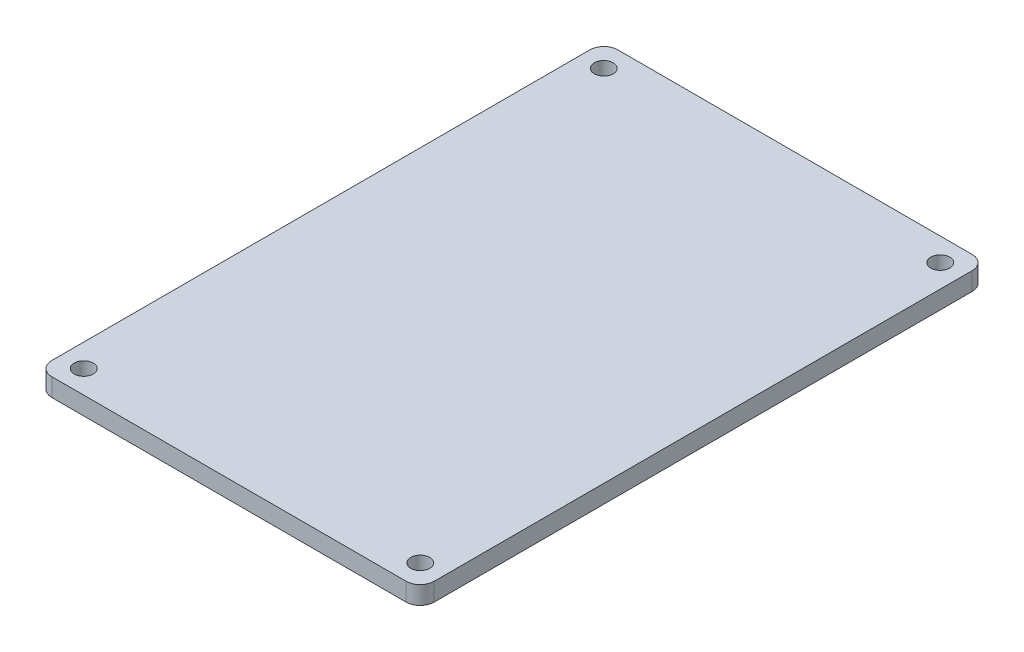
ISO-10303-21;
HEADER;
FILE_DESCRIPTION(('STEP AP214'),'2;1');
FILE_NAME('part.step','',(''),(''),'','','');
FILE_SCHEMA(('AUTOMOTIVE_DESIGN { 1 0 10303 214 1 1 1 1 }'));
ENDSEC;
DATA;
#1=APPLICATION_CONTEXT('core data for automotive mechanical design processes');
#2=APPLICATION_PROTOCOL_DEFINITION('international standard','automotive_design',2000,#1);
#3=PRODUCT_CONTEXT('',#1,'mechanical');
#4=PRODUCT('Part','Part','',(#3));
#5=PRODUCT_RELATED_PRODUCT_CATEGORY('part','',(#4));
#6=PRODUCT_DEFINITION_FORMATION('','',#4);
#7=PRODUCT_DEFINITION_CONTEXT('part definition',#1,'design');
#8=PRODUCT_DEFINITION('design','',#6,#7);
#9=PRODUCT_DEFINITION_SHAPE('','',#8);
#10=(LENGTH_UNIT() NAMED_UNIT(*) SI_UNIT(.MILLI.,.METRE.));
#11=(NAMED_UNIT(*) PLANE_ANGLE_UNIT() SI_UNIT($,.RADIAN.));
#12=(NAMED_UNIT(*) SI_UNIT($,.STERADIAN.) SOLID_ANGLE_UNIT());
#13=UNCERTAINTY_MEASURE_WITH_UNIT(LENGTH_MEASURE(1.E-05),#10,'distance_accuracy_value','');
#14=(GEOMETRIC_REPRESENTATION_CONTEXT(3) GLOBAL_UNCERTAINTY_ASSIGNED_CONTEXT((#13)) GLOBAL_UNIT_ASSIGNED_CONTEXT((#10,
#11,#12)) REPRESENTATION_CONTEXT('',''));
#15=CARTESIAN_POINT('',(0.,0.,0.));
#16=DIRECTION('',(0.,0.,1.));
#17=DIRECTION('',(1.,0.,0.));
#18=AXIS2_PLACEMENT_3D('',#15,#16,#17);
#19=CARTESIAN_POINT('',(-29.43,3.,44.68));
#20=DIRECTION('',(0.,-1.,0.));
#21=DIRECTION('',(0.,0.,-1.));
#22=AXIS2_PLACEMENT_3D('',#19,#20,#21);
#23=PLANE('',#22);
#24=CARTESIAN_POINT('',(27.94,3.,-43.18));
#25=DIRECTION('',(0.,1.,0.));
#26=DIRECTION('',(0.,0.,1.));
#27=AXIS2_PLACEMENT_3D('',#24,#25,#26);
#28=CIRCLE('',#27,1.58);
#29=CARTESIAN_POINT('',(27.94,3.,-41.6));
#30=VERTEX_POINT('',#29);
#31=EDGE_CURVE('E200',#30,#30,#28,.T.);
#32=ORIENTED_EDGE('',*,*,#31,.F.);
#33=EDGE_LOOP('',(#32));
#34=FACE_BOUND('',#33,.T.);
#35=CARTESIAN_POINT('',(-27.94,3.,-43.18));
#36=DIRECTION('',(0.,1.,0.));
#37=DIRECTION('',(0.,0.,1.));
#38=AXIS2_PLACEMENT_3D('',#35,#36,#37);
#39=CIRCLE('',#38,1.58);
#40=CARTESIAN_POINT('',(-27.94,3.,-41.6));
#41=VERTEX_POINT('',#40);
#42=EDGE_CURVE('E194',#41,#41,#39,.T.);
#43=ORIENTED_EDGE('',*,*,#42,.F.);
#44=EDGE_LOOP('',(#43));
#45=FACE_BOUND('',#44,.T.);
#46=CARTESIAN_POINT('',(27.94,3.,43.18));
#47=DIRECTION('',(0.,1.,0.));
#48=DIRECTION('',(0.,0.,1.));
#49=AXIS2_PLACEMENT_3D('',#46,#47,#48);
#50=CIRCLE('',#49,1.58);
#51=CARTESIAN_POINT('',(27.94,3.,44.76));
#52=VERTEX_POINT('',#51);
#53=EDGE_CURVE('E182',#52,#52,#50,.T.);
#54=ORIENTED_EDGE('',*,*,#53,.F.);
#55=EDGE_LOOP('',(#54));
#56=FACE_BOUND('',#55,.T.);
#57=CARTESIAN_POINT('',(-29.43,3.,44.68));
#58=DIRECTION('',(0.,1.,0.));
#59=DIRECTION('',(0.,0.,-1.));
#60=AXIS2_PLACEMENT_3D('',#57,#58,#59);
#61=CIRCLE('',#60,2.32);
#62=CARTESIAN_POINT('',(-31.75,3.,44.68));
#63=VERTEX_POINT('',#62);
#64=CARTESIAN_POINT('',(-29.43,3.,47.));
#65=VERTEX_POINT('',#64);
#66=EDGE_CURVE('E146',#63,#65,#61,.T.);
#67=ORIENTED_EDGE('',*,*,#66,.T.);
#68=DIRECTION('',(1.,0.,0.));
#69=VECTOR('',#68,1.);
#70=CARTESIAN_POINT('',(-29.43,3.,47.));
#71=LINE('',#70,#69);
#72=CARTESIAN_POINT('',(29.43,3.,47.));
#73=VERTEX_POINT('',#72);
#74=EDGE_CURVE('E94',#65,#73,#71,.T.);
#75=ORIENTED_EDGE('',*,*,#74,.T.);
#76=CARTESIAN_POINT('',(29.43,3.,44.68));
#77=DIRECTION('',(0.,1.,0.));
#78=DIRECTION('',(0.,0.,1.));
#79=AXIS2_PLACEMENT_3D('',#76,#77,#78);
#80=CIRCLE('',#79,2.32);
#81=CARTESIAN_POINT('',(31.75,3.,44.68));
#82=VERTEX_POINT('',#81);
#83=EDGE_CURVE('E161',#73,#82,#80,.T.);
#84=ORIENTED_EDGE('',*,*,#83,.T.);
#85=DIRECTION('',(0.,0.,-1.));
#86=VECTOR('',#85,1.);
#87=CARTESIAN_POINT('',(31.75,3.,44.68));
#88=LINE('',#87,#86);
#89=CARTESIAN_POINT('',(31.75,3.,-44.68));
#90=VERTEX_POINT('',#89);
#91=EDGE_CURVE('E174',#82,#90,#88,.T.);
#92=ORIENTED_EDGE('',*,*,#91,.T.);
#93=CARTESIAN_POINT('',(29.43,3.,-44.68));
#94=DIRECTION('',(0.,1.,0.));
#95=DIRECTION('',(0.,0.,-1.));
#96=AXIS2_PLACEMENT_3D('',#93,#94,#95);
#97=CIRCLE('',#96,2.32);
#98=CARTESIAN_POINT('',(29.43,3.,-47.));
#99=VERTEX_POINT('',#98);
#100=EDGE_CURVE('E113',#90,#99,#97,.T.);
#101=ORIENTED_EDGE('',*,*,#100,.T.);
#102=DIRECTION('',(-1.,0.,0.));
#103=VECTOR('',#102,1.);
#104=CARTESIAN_POINT('',(-29.43,3.,-47.));
#105=LINE('',#104,#103);
#106=CARTESIAN_POINT('',(-29.43,3.,-47.));
#107=VERTEX_POINT('',#106);
#108=EDGE_CURVE('E107',#99,#107,#105,.T.);
#109=ORIENTED_EDGE('',*,*,#108,.T.);
#110=CARTESIAN_POINT('',(-29.43,3.,-44.68));
#111=DIRECTION('',(0.,1.,0.));
#112=DIRECTION('',(0.,0.,1.));
#113=AXIS2_PLACEMENT_3D('',#110,#111,#112);
#114=CIRCLE('',#113,2.32);
#115=CARTESIAN_POINT('',(-31.75,3.,-44.68));
#116=VERTEX_POINT('',#115);
#117=EDGE_CURVE('E111',#107,#116,#114,.T.);
#118=ORIENTED_EDGE('',*,*,#117,.T.);
#119=DIRECTION('',(0.,0.,1.));
#120=VECTOR('',#119,1.);
#121=CARTESIAN_POINT('',(-31.75,3.,44.68));
#122=LINE('',#121,#120);
#123=EDGE_CURVE('E51',#116,#63,#122,.T.);
#124=ORIENTED_EDGE('',*,*,#123,.T.);
#125=EDGE_LOOP('',(#67,#75,#84,#92,#101,#109,#118,#124));
#126=FACE_BOUND('',#125,.T.);
#127=CARTESIAN_POINT('',(-27.94,3.,43.18));
#128=DIRECTION('',(0.,1.,0.));
#129=DIRECTION('',(0.,0.,1.));
#130=AXIS2_PLACEMENT_3D('',#127,#128,#129);
#131=CIRCLE('',#130,1.58);
#132=CARTESIAN_POINT('',(-27.94,3.,44.76));
#133=VERTEX_POINT('',#132);
#134=EDGE_CURVE('E188',#133,#133,#131,.T.);
#135=ORIENTED_EDGE('',*,*,#134,.F.);
#136=EDGE_LOOP('',(#135));
#137=FACE_BOUND('',#136,.T.);
#138=ADVANCED_FACE('F34',(#34,#45,#56,#126,#137),#23,.F.);
#139=CARTESIAN_POINT('',(-29.43,0.,44.68));
#140=DIRECTION('',(0.,-1.,0.));
#141=DIRECTION('',(0.,0.,-1.));
#142=AXIS2_PLACEMENT_3D('',#139,#140,#141);
#143=PLANE('',#142);
#144=CARTESIAN_POINT('',(27.94,0.,-43.18));
#145=DIRECTION('',(0.,1.,0.));
#146=DIRECTION('',(0.,0.,1.));
#147=AXIS2_PLACEMENT_3D('',#144,#145,#146);
#148=CIRCLE('',#147,1.58);
#149=CARTESIAN_POINT('',(27.94,0.,-41.6));
#150=VERTEX_POINT('',#149);
#151=EDGE_CURVE('E197',#150,#150,#148,.T.);
#152=ORIENTED_EDGE('',*,*,#151,.T.);
#153=EDGE_LOOP('',(#152));
#154=FACE_BOUND('',#153,.T.);
#155=CARTESIAN_POINT('',(-27.94,0.,-43.18));
#156=DIRECTION('',(0.,1.,0.));
#157=DIRECTION('',(0.,0.,1.));
#158=AXIS2_PLACEMENT_3D('',#155,#156,#157);
#159=CIRCLE('',#158,1.58);
#160=CARTESIAN_POINT('',(-27.94,0.,-41.6));
#161=VERTEX_POINT('',#160);
#162=EDGE_CURVE('E191',#161,#161,#159,.T.);
#163=ORIENTED_EDGE('',*,*,#162,.T.);
#164=EDGE_LOOP('',(#163));
#165=FACE_BOUND('',#164,.T.);
#166=CARTESIAN_POINT('',(-27.94,0.,43.18));
#167=DIRECTION('',(0.,1.,0.));
#168=DIRECTION('',(0.,0.,1.));
#169=AXIS2_PLACEMENT_3D('',#166,#167,#168);
#170=CIRCLE('',#169,1.58);
#171=CARTESIAN_POINT('',(-27.94,0.,44.76));
#172=VERTEX_POINT('',#171);
#173=EDGE_CURVE('E185',#172,#172,#170,.T.);
#174=ORIENTED_EDGE('',*,*,#173,.T.);
#175=EDGE_LOOP('',(#174));
#176=FACE_BOUND('',#175,.T.);
#177=CARTESIAN_POINT('',(-29.43,0.,44.68));
#178=DIRECTION('',(0.,1.,0.));
#179=DIRECTION('',(0.,0.,-1.));
#180=AXIS2_PLACEMENT_3D('',#177,#178,#179);
#181=CIRCLE('',#180,2.32);
#182=CARTESIAN_POINT('',(-31.75,0.,44.68));
#183=VERTEX_POINT('',#182);
#184=CARTESIAN_POINT('',(-29.43,0.,47.));
#185=VERTEX_POINT('',#184);
#186=EDGE_CURVE('E131',#183,#185,#181,.T.);
#187=ORIENTED_EDGE('',*,*,#186,.F.);
#188=DIRECTION('',(0.,0.,1.));
#189=VECTOR('',#188,1.);
#190=CARTESIAN_POINT('',(-31.75,0.,44.68));
#191=LINE('',#190,#189);
#192=CARTESIAN_POINT('',(-31.75,0.,-44.68));
#193=VERTEX_POINT('',#192);
#194=EDGE_CURVE('E86',#193,#183,#191,.T.);
#195=ORIENTED_EDGE('',*,*,#194,.F.);
#196=CARTESIAN_POINT('',(-29.43,0.,-44.68));
#197=DIRECTION('',(0.,1.,0.));
#198=DIRECTION('',(0.,0.,1.));
#199=AXIS2_PLACEMENT_3D('',#196,#197,#198);
#200=CIRCLE('',#199,2.32);
#201=CARTESIAN_POINT('',(-29.43,0.,-47.));
#202=VERTEX_POINT('',#201);
#203=EDGE_CURVE('E80',#202,#193,#200,.T.);
#204=ORIENTED_EDGE('',*,*,#203,.F.);
#205=DIRECTION('',(-1.,0.,0.));
#206=VECTOR('',#205,1.);
#207=CARTESIAN_POINT('',(-29.43,0.,-47.));
#208=LINE('',#207,#206);
#209=CARTESIAN_POINT('',(29.43,0.,-47.));
#210=VERTEX_POINT('',#209);
#211=EDGE_CURVE('E121',#210,#202,#208,.T.);
#212=ORIENTED_EDGE('',*,*,#211,.F.);
#213=CARTESIAN_POINT('',(29.43,0.,-44.68));
#214=DIRECTION('',(0.,1.,0.));
#215=DIRECTION('',(0.,0.,-1.));
#216=AXIS2_PLACEMENT_3D('',#213,#214,#215);
#217=CIRCLE('',#216,2.32);
#218=CARTESIAN_POINT('',(31.75,0.,-44.68));
#219=VERTEX_POINT('',#218);
#220=EDGE_CURVE('E141',#219,#210,#217,.T.);
#221=ORIENTED_EDGE('',*,*,#220,.F.);
#222=DIRECTION('',(0.,0.,-1.));
#223=VECTOR('',#222,1.);
#224=CARTESIAN_POINT('',(31.75,0.,44.68));
#225=LINE('',#224,#223);
#226=CARTESIAN_POINT('',(31.75,0.,44.68));
#227=VERTEX_POINT('',#226);
#228=EDGE_CURVE('E139',#227,#219,#225,.T.);
#229=ORIENTED_EDGE('',*,*,#228,.F.);
#230=CARTESIAN_POINT('',(29.43,0.,44.68));
#231=DIRECTION('',(0.,1.,0.));
#232=DIRECTION('',(0.,0.,1.));
#233=AXIS2_PLACEMENT_3D('',#230,#231,#232);
#234=CIRCLE('',#233,2.32);
#235=CARTESIAN_POINT('',(29.43,0.,47.));
#236=VERTEX_POINT('',#235);
#237=EDGE_CURVE('E137',#236,#227,#234,.T.);
#238=ORIENTED_EDGE('',*,*,#237,.F.);
#239=DIRECTION('',(1.,0.,0.));
#240=VECTOR('',#239,1.);
#241=CARTESIAN_POINT('',(-29.43,0.,47.));
#242=LINE('',#241,#240);
#243=EDGE_CURVE('E134',#185,#236,#242,.T.);
#244=ORIENTED_EDGE('',*,*,#243,.F.);
#245=EDGE_LOOP('',(#187,#195,#204,#212,#221,#229,#238,#244));
#246=FACE_BOUND('',#245,.T.);
#247=CARTESIAN_POINT('',(27.94,0.,43.18));
#248=DIRECTION('',(0.,1.,0.));
#249=DIRECTION('',(0.,0.,1.));
#250=AXIS2_PLACEMENT_3D('',#247,#248,#249);
#251=CIRCLE('',#250,1.58);
#252=CARTESIAN_POINT('',(27.94,0.,44.76));
#253=VERTEX_POINT('',#252);
#254=EDGE_CURVE('E135',#253,#253,#251,.T.);
#255=ORIENTED_EDGE('',*,*,#254,.T.);
#256=EDGE_LOOP('',(#255));
#257=FACE_BOUND('',#256,.T.);
#258=ADVANCED_FACE('F165',(#154,#165,#176,#246,#257),#143,.T.);
#259=CARTESIAN_POINT('',(-29.43,3.,44.68));
#260=DIRECTION('',(0.,-1.,0.));
#261=DIRECTION('',(0.,0.,-1.));
#262=AXIS2_PLACEMENT_3D('',#259,#260,#261);
#263=CYLINDRICAL_SURFACE('',#262,2.32);
#264=ORIENTED_EDGE('',*,*,#186,.T.);
#265=DIRECTION('',(0.,-1.,0.));
#266=VECTOR('',#265,1.);
#267=CARTESIAN_POINT('',(-29.43,3.,47.));
#268=LINE('',#267,#266);
#269=EDGE_CURVE('E11',#65,#185,#268,.T.);
#270=ORIENTED_EDGE('',*,*,#269,.F.);
#271=ORIENTED_EDGE('',*,*,#66,.F.);
#272=DIRECTION('',(0.,-1.,0.));
#273=VECTOR('',#272,1.);
#274=CARTESIAN_POINT('',(-31.75,3.,44.68));
#275=LINE('',#274,#273);
#276=EDGE_CURVE('E127',#63,#183,#275,.T.);
#277=ORIENTED_EDGE('',*,*,#276,.T.);
#278=EDGE_LOOP('',(#264,#270,#271,#277));
#279=FACE_BOUND('',#278,.T.);
#280=ADVANCED_FACE('F36',(#279),#263,.T.);
#281=CARTESIAN_POINT('',(-29.43,3.,47.));
#282=DIRECTION('',(0.,0.,-1.));
#283=DIRECTION('',(-1.,0.,0.));
#284=AXIS2_PLACEMENT_3D('',#281,#282,#283);
#285=PLANE('',#284);
#286=ORIENTED_EDGE('',*,*,#243,.T.);
#287=DIRECTION('',(0.,-1.,0.));
#288=VECTOR('',#287,1.);
#289=CARTESIAN_POINT('',(29.43,3.,47.));
#290=LINE('',#289,#288);
#291=EDGE_CURVE('E43',#73,#236,#290,.T.);
#292=ORIENTED_EDGE('',*,*,#291,.F.);
#293=ORIENTED_EDGE('',*,*,#74,.F.);
#294=ORIENTED_EDGE('',*,*,#269,.T.);
#295=EDGE_LOOP('',(#286,#292,#293,#294));
#296=FACE_BOUND('',#295,.T.);
#297=ADVANCED_FACE('F242',(#296),#285,.F.);
#298=CARTESIAN_POINT('',(29.43,3.,44.68));
#299=DIRECTION('',(0.,-1.,0.));
#300=DIRECTION('',(0.,0.,-1.));
#301=AXIS2_PLACEMENT_3D('',#298,#299,#300);
#302=CYLINDRICAL_SURFACE('',#301,2.32);
#303=ORIENTED_EDGE('',*,*,#237,.T.);
#304=DIRECTION('',(0.,-1.,0.));
#305=VECTOR('',#304,1.);
#306=CARTESIAN_POINT('',(31.75,3.,44.68));
#307=LINE('',#306,#305);
#308=EDGE_CURVE('E153',#82,#227,#307,.T.);
#309=ORIENTED_EDGE('',*,*,#308,.F.);
#310=ORIENTED_EDGE('',*,*,#83,.F.);
#311=ORIENTED_EDGE('',*,*,#291,.T.);
#312=EDGE_LOOP('',(#303,#309,#310,#311));
#313=FACE_BOUND('',#312,.T.);
#314=ADVANCED_FACE('F159',(#313),#302,.T.);
#315=CARTESIAN_POINT('',(31.75,3.,44.68));
#316=DIRECTION('',(-1.,0.,0.));
#317=DIRECTION('',(0.,0.,1.));
#318=AXIS2_PLACEMENT_3D('',#315,#316,#317);
#319=PLANE('',#318);
#320=ORIENTED_EDGE('',*,*,#228,.T.);
#321=DIRECTION('',(0.,-1.,0.));
#322=VECTOR('',#321,1.);
#323=CARTESIAN_POINT('',(31.75,3.,-44.68));
#324=LINE('',#323,#322);
#325=EDGE_CURVE('E150',#90,#219,#324,.T.);
#326=ORIENTED_EDGE('',*,*,#325,.F.);
#327=ORIENTED_EDGE('',*,*,#91,.F.);
#328=ORIENTED_EDGE('',*,*,#308,.T.);
#329=EDGE_LOOP('',(#320,#326,#327,#328));
#330=FACE_BOUND('',#329,.T.);
#331=ADVANCED_FACE('F170',(#330),#319,.F.);
#332=CARTESIAN_POINT('',(29.43,3.,-44.68));
#333=DIRECTION('',(0.,-1.,0.));
#334=DIRECTION('',(0.,0.,-1.));
#335=AXIS2_PLACEMENT_3D('',#332,#333,#334);
#336=CYLINDRICAL_SURFACE('',#335,2.32);
#337=ORIENTED_EDGE('',*,*,#220,.T.);
#338=DIRECTION('',(0.,-1.,0.));
#339=VECTOR('',#338,1.);
#340=CARTESIAN_POINT('',(29.43,3.,-47.));
#341=LINE('',#340,#339);
#342=EDGE_CURVE('E122',#99,#210,#341,.T.);
#343=ORIENTED_EDGE('',*,*,#342,.F.);
#344=ORIENTED_EDGE('',*,*,#100,.F.);
#345=ORIENTED_EDGE('',*,*,#325,.T.);
#346=EDGE_LOOP('',(#337,#343,#344,#345));
#347=FACE_BOUND('',#346,.T.);
#348=ADVANCED_FACE('F173',(#347),#336,.T.);
#349=CARTESIAN_POINT('',(-29.43,3.,-47.));
#350=DIRECTION('',(0.,0.,1.));
#351=DIRECTION('',(1.,0.,0.));
#352=AXIS2_PLACEMENT_3D('',#349,#350,#351);
#353=PLANE('',#352);
#354=ORIENTED_EDGE('',*,*,#211,.T.);
#355=DIRECTION('',(0.,-1.,0.));
#356=VECTOR('',#355,1.);
#357=CARTESIAN_POINT('',(-29.43,3.,-47.));
#358=LINE('',#357,#356);
#359=EDGE_CURVE('E118',#107,#202,#358,.T.);
#360=ORIENTED_EDGE('',*,*,#359,.F.);
#361=ORIENTED_EDGE('',*,*,#108,.F.);
#362=ORIENTED_EDGE('',*,*,#342,.T.);
#363=EDGE_LOOP('',(#354,#360,#361,#362));
#364=FACE_BOUND('',#363,.T.);
#365=ADVANCED_FACE('F119',(#364),#353,.F.);
#366=CARTESIAN_POINT('',(-29.43,3.,-44.68));
#367=DIRECTION('',(0.,-1.,0.));
#368=DIRECTION('',(0.,0.,-1.));
#369=AXIS2_PLACEMENT_3D('',#366,#367,#368);
#370=CYLINDRICAL_SURFACE('',#369,2.32);
#371=ORIENTED_EDGE('',*,*,#203,.T.);
#372=DIRECTION('',(0.,-1.,0.));
#373=VECTOR('',#372,1.);
#374=CARTESIAN_POINT('',(-31.75,3.,-44.68));
#375=LINE('',#374,#373);
#376=EDGE_CURVE('E123',#116,#193,#375,.T.);
#377=ORIENTED_EDGE('',*,*,#376,.F.);
#378=ORIENTED_EDGE('',*,*,#117,.F.);
#379=ORIENTED_EDGE('',*,*,#359,.T.);
#380=EDGE_LOOP('',(#371,#377,#378,#379));
#381=FACE_BOUND('',#380,.T.);
#382=ADVANCED_FACE('F125',(#381),#370,.T.);
#383=CARTESIAN_POINT('',(-31.75,3.,44.68));
#384=DIRECTION('',(1.,0.,0.));
#385=DIRECTION('',(0.,0.,-1.));
#386=AXIS2_PLACEMENT_3D('',#383,#384,#385);
#387=PLANE('',#386);
#388=ORIENTED_EDGE('',*,*,#194,.T.);
#389=ORIENTED_EDGE('',*,*,#276,.F.);
#390=ORIENTED_EDGE('',*,*,#123,.F.);
#391=ORIENTED_EDGE('',*,*,#376,.T.);
#392=EDGE_LOOP('',(#388,#389,#390,#391));
#393=FACE_BOUND('',#392,.T.);
#394=ADVANCED_FACE('F216',(#393),#387,.F.);
#395=CARTESIAN_POINT('',(27.94,3.,43.18));
#396=DIRECTION('',(0.,1.,0.));
#397=DIRECTION('',(0.,0.,1.));
#398=AXIS2_PLACEMENT_3D('',#395,#396,#397);
#399=CYLINDRICAL_SURFACE('',#398,1.58);
#400=ORIENTED_EDGE('',*,*,#254,.F.);
#401=EDGE_LOOP('',(#400));
#402=FACE_BOUND('',#401,.T.);
#403=ORIENTED_EDGE('',*,*,#53,.T.);
#404=EDGE_LOOP('',(#403));
#405=FACE_BOUND('',#404,.T.);
#406=ADVANCED_FACE('F213',(#402,#405),#399,.F.);
#407=CARTESIAN_POINT('',(-27.94,3.,43.18));
#408=DIRECTION('',(0.,1.,0.));
#409=DIRECTION('',(0.,0.,1.));
#410=AXIS2_PLACEMENT_3D('',#407,#408,#409);
#411=CYLINDRICAL_SURFACE('',#410,1.58);
#412=ORIENTED_EDGE('',*,*,#173,.F.);
#413=EDGE_LOOP('',(#412));
#414=FACE_BOUND('',#413,.T.);
#415=ORIENTED_EDGE('',*,*,#134,.T.);
#416=EDGE_LOOP('',(#415));
#417=FACE_BOUND('',#416,.T.);
#418=ADVANCED_FACE('F215',(#414,#417),#411,.F.);
#419=CARTESIAN_POINT('',(-27.94,3.,-43.18));
#420=DIRECTION('',(0.,1.,0.));
#421=DIRECTION('',(0.,0.,1.));
#422=AXIS2_PLACEMENT_3D('',#419,#420,#421);
#423=CYLINDRICAL_SURFACE('',#422,1.58);
#424=ORIENTED_EDGE('',*,*,#162,.F.);
#425=EDGE_LOOP('',(#424));
#426=FACE_BOUND('',#425,.T.);
#427=ORIENTED_EDGE('',*,*,#42,.T.);
#428=EDGE_LOOP('',(#427));
#429=FACE_BOUND('',#428,.T.);
#430=ADVANCED_FACE('F223',(#426,#429),#423,.F.);
#431=CARTESIAN_POINT('',(27.94,3.,-43.18));
#432=DIRECTION('',(0.,1.,0.));
#433=DIRECTION('',(0.,0.,1.));
#434=AXIS2_PLACEMENT_3D('',#431,#432,#433);
#435=CYLINDRICAL_SURFACE('',#434,1.58);
#436=ORIENTED_EDGE('',*,*,#151,.F.);
#437=EDGE_LOOP('',(#436));
#438=FACE_BOUND('',#437,.T.);
#439=ORIENTED_EDGE('',*,*,#31,.T.);
#440=EDGE_LOOP('',(#439));
#441=FACE_BOUND('',#440,.T.);
#442=ADVANCED_FACE('F204',(#438,#441),#435,.F.);
#443=CLOSED_SHELL('',(#138,#258,#280,#297,#314,#331,#348,#365,#382,#394,#406,#418,#430,#442));
#444=MANIFOLD_SOLID_BREP('B2',#443);
#445=ADVANCED_BREP_SHAPE_REPRESENTATION('',(#18,#444),#14);
#446=SHAPE_DEFINITION_REPRESENTATION(#9,#445);
ENDSEC;
END-ISO-10303-21;
